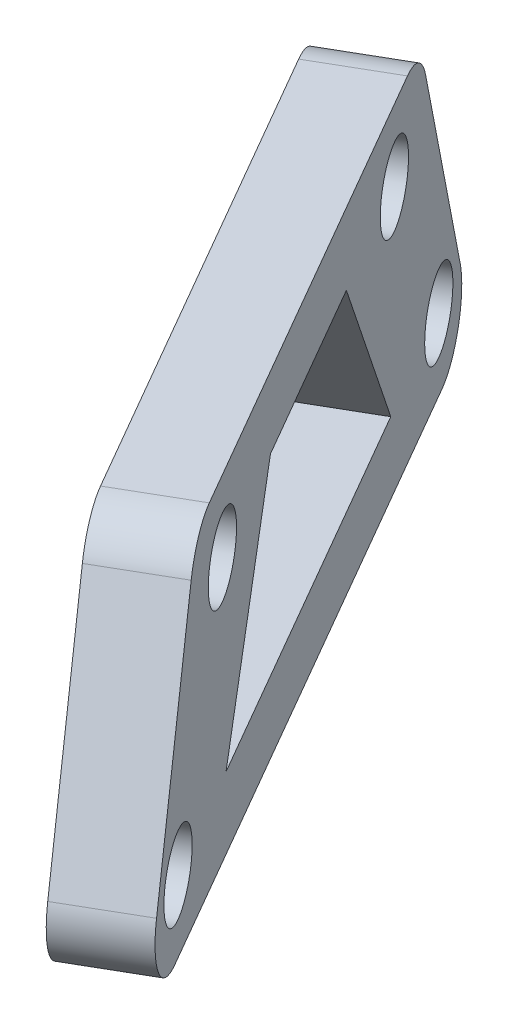
ISO-10303-21;
HEADER;
FILE_DESCRIPTION(('STEP AP214'),'2;1');
FILE_NAME('part.step','',(''),(''),'','','');
FILE_SCHEMA(('AUTOMOTIVE_DESIGN { 1 0 10303 214 1 1 1 1 }'));
ENDSEC;
DATA;
#1=APPLICATION_CONTEXT('core data for automotive mechanical design processes');
#2=APPLICATION_PROTOCOL_DEFINITION('international standard','automotive_design',2000,#1);
#3=PRODUCT_CONTEXT('',#1,'mechanical');
#4=PRODUCT('Part','Part','',(#3));
#5=PRODUCT_RELATED_PRODUCT_CATEGORY('part','',(#4));
#6=PRODUCT_DEFINITION_FORMATION('','',#4);
#7=PRODUCT_DEFINITION_CONTEXT('part definition',#1,'design');
#8=PRODUCT_DEFINITION('design','',#6,#7);
#9=PRODUCT_DEFINITION_SHAPE('','',#8);
#10=(LENGTH_UNIT() NAMED_UNIT(*) SI_UNIT(.MILLI.,.METRE.));
#11=(NAMED_UNIT(*) PLANE_ANGLE_UNIT() SI_UNIT($,.RADIAN.));
#12=(NAMED_UNIT(*) SI_UNIT($,.STERADIAN.) SOLID_ANGLE_UNIT());
#13=UNCERTAINTY_MEASURE_WITH_UNIT(LENGTH_MEASURE(1.E-05),#10,'distance_accuracy_value','');
#14=(GEOMETRIC_REPRESENTATION_CONTEXT(3) GLOBAL_UNCERTAINTY_ASSIGNED_CONTEXT((#13)) GLOBAL_UNIT_ASSIGNED_CONTEXT((#10,
#11,#12)) REPRESENTATION_CONTEXT('',''));
#15=CARTESIAN_POINT('',(0.,0.,0.));
#16=DIRECTION('',(0.,0.,1.));
#17=DIRECTION('',(1.,0.,0.));
#18=AXIS2_PLACEMENT_3D('',#15,#16,#17);
#19=CARTESIAN_POINT('',(2.98789255612336,118.055853922029,26.7488933733079));
#20=DIRECTION('',(0.,-1.,0.));
#21=DIRECTION('',(1.,0.,0.));
#22=AXIS2_PLACEMENT_3D('',#19,#20,#21);
#23=PLANE('',#22);
#24=DIRECTION('',(0.500000000000002,0.,0.866025403784437));
#25=VECTOR('',#24,1.);
#26=CARTESIAN_POINT('',(2.98789255612336,118.055853922029,26.7488933733079));
#27=LINE('',#26,#25);
#28=CARTESIAN_POINT('',(-19.6627885870859,118.055853922029,-12.4832371927726));
#29=VERTEX_POINT('',#28);
#30=CARTESIAN_POINT('',(0.741907032665852,118.055853922029,22.8587323336153));
#31=VERTEX_POINT('',#30);
#32=EDGE_CURVE('E197',#29,#31,#27,.T.);
#33=ORIENTED_EDGE('',*,*,#32,.T.);
#34=DIRECTION('',(-0.866025403784437,0.,0.500000000000002));
#35=VECTOR('',#34,1.);
#36=CARTESIAN_POINT('',(0.741907032665852,118.055853922029,22.8587323336153));
#37=LINE('',#36,#35);
#38=CARTESIAN_POINT('',(-3.1119060141749,118.055853922029,25.0837323336154));
#39=VERTEX_POINT('',#38);
#40=EDGE_CURVE('E221',#31,#39,#37,.T.);
#41=ORIENTED_EDGE('',*,*,#40,.T.);
#42=DIRECTION('',(0.500000000000002,0.,0.866025403784437));
#43=VECTOR('',#42,1.);
#44=CARTESIAN_POINT('',(-0.865920490717391,118.055853922029,28.9738933733079));
#45=LINE('',#44,#43);
#46=CARTESIAN_POINT('',(-23.5166016339266,118.055853922029,-10.2582371927726));
#47=VERTEX_POINT('',#46);
#48=EDGE_CURVE('E194',#47,#39,#45,.T.);
#49=ORIENTED_EDGE('',*,*,#48,.F.);
#50=DIRECTION('',(-0.866025403784438,0.,0.500000000000002));
#51=VECTOR('',#50,1.);
#52=CARTESIAN_POINT('',(-19.6627885870859,118.055853922029,-12.4832371927726));
#53=LINE('',#52,#51);
#54=EDGE_CURVE('E209',#47,#29,#53,.F.);
#55=ORIENTED_EDGE('',*,*,#54,.T.);
#56=EDGE_LOOP('',(#33,#41,#49,#55));
#57=FACE_BOUND('',#56,.T.);
#58=ADVANCED_FACE('F39',(#57),#23,.T.);
#59=CARTESIAN_POINT('',(-21.9087741105434,118.055853922029,-16.3733982324652));
#60=DIRECTION('',(-0.461854949510508,0.383092707383721,-0.799956238279355));
#61=DIRECTION('',(-0.866025403784438,0.,0.500000000000002));
#62=AXIS2_PLACEMENT_3D('',#59,#60,#61);
#63=PLANE('',#62);
#64=DIRECTION('',(-0.191546353691861,-0.923709899021013,-0.33176801659886));
#65=VECTOR('',#64,1.);
#66=CARTESIAN_POINT('',(-25.7625871573841,118.055853922029,-14.1483982324652));
#67=LINE('',#66,#65);
#68=CARTESIAN_POINT('',(-22.2596979383505,134.948127695094,-8.08121613181374));
#69=VERTEX_POINT('',#68);
#70=CARTESIAN_POINT('',(-24.9021664824582,122.20513204418,-12.6581059076107));
#71=VERTEX_POINT('',#70);
#72=EDGE_CURVE('E201',#69,#71,#67,.T.);
#73=ORIENTED_EDGE('',*,*,#72,.F.);
#74=DIRECTION('',(-0.866025403784438,0.,0.500000000000002));
#75=VECTOR('',#74,1.);
#76=CARTESIAN_POINT('',(-18.4058848915098,134.948127695094,-10.3062161318137));
#77=LINE('',#76,#75);
#78=CARTESIAN_POINT('',(-18.4058848915098,134.948127695094,-10.3062161318137));
#79=VERTEX_POINT('',#78);
#80=EDGE_CURVE('E11',#69,#79,#77,.F.);
#81=ORIENTED_EDGE('',*,*,#80,.T.);
#82=DIRECTION('',(-0.191546353691861,-0.923709899021013,-0.33176801659886));
#83=VECTOR('',#82,1.);
#84=CARTESIAN_POINT('',(-21.9087741105434,118.055853922029,-16.3733982324652));
#85=LINE('',#84,#83);
#86=CARTESIAN_POINT('',(-21.0483534356174,122.20513204418,-14.8831059076107));
#87=VERTEX_POINT('',#86);
#88=EDGE_CURVE('E206',#79,#87,#85,.T.);
#89=ORIENTED_EDGE('',*,*,#88,.T.);
#90=DIRECTION('',(-0.866025403784438,0.,0.500000000000002));
#91=VECTOR('',#90,1.);
#92=CARTESIAN_POINT('',(-21.0483534356174,122.20513204418,-14.8831059076107));
#93=LINE('',#92,#91);
#94=EDGE_CURVE('E47',#87,#71,#93,.T.);
#95=ORIENTED_EDGE('',*,*,#94,.T.);
#96=EDGE_LOOP('',(#73,#81,#89,#95));
#97=FACE_BOUND('',#96,.T.);
#98=ADVANCED_FACE('F251',(#97),#63,.T.);
#99=CARTESIAN_POINT('',(-18.0221074438767,136.798849572943,-9.64149409371414));
#100=DIRECTION('',(0.,1.,0.));
#101=DIRECTION('',(-1.,0.,0.));
#102=AXIS2_PLACEMENT_3D('',#99,#100,#101);
#103=PLANE('',#102);
#104=DIRECTION('',(-0.500000000000002,0.,-0.866025403784437));
#105=VECTOR('',#104,1.);
#106=CARTESIAN_POINT('',(-21.8759204907175,136.798849572943,-7.41649409371413));
#107=LINE('',#106,#105);
#108=CARTESIAN_POINT('',(-5.75437455828251,136.798849572943,20.5068425578184));
#109=VERTEX_POINT('',#108);
#110=CARTESIAN_POINT('',(-20.874133089819,136.798849572943,-5.68134741697567));
#111=VERTEX_POINT('',#110);
#112=EDGE_CURVE('E215',#109,#111,#107,.T.);
#113=ORIENTED_EDGE('',*,*,#112,.F.);
#114=DIRECTION('',(-0.866025403784437,0.,0.500000000000002));
#115=VECTOR('',#114,1.);
#116=CARTESIAN_POINT('',(-1.90056151144176,136.798849572943,18.2818425578184));
#117=LINE('',#116,#115);
#118=CARTESIAN_POINT('',(-1.90056151144176,136.798849572943,18.2818425578184));
#119=VERTEX_POINT('',#118);
#120=EDGE_CURVE('E61',#109,#119,#117,.F.);
#121=ORIENTED_EDGE('',*,*,#120,.T.);
#122=DIRECTION('',(-0.500000000000002,0.,-0.866025403784437));
#123=VECTOR('',#122,1.);
#124=CARTESIAN_POINT('',(-18.0221074438767,136.798849572943,-9.64149409371414));
#125=LINE('',#124,#123);
#126=CARTESIAN_POINT('',(-17.0203200429783,136.798849572943,-7.90634741697568));
#127=VERTEX_POINT('',#126);
#128=EDGE_CURVE('E204',#119,#127,#125,.T.);
#129=ORIENTED_EDGE('',*,*,#128,.T.);
#130=DIRECTION('',(-0.866025403784438,0.,0.500000000000002));
#131=VECTOR('',#130,1.);
#132=CARTESIAN_POINT('',(-17.0203200429783,136.798849572943,-7.90634741697568));
#133=LINE('',#132,#131);
#134=EDGE_CURVE('E244',#127,#111,#133,.T.);
#135=ORIENTED_EDGE('',*,*,#134,.T.);
#136=EDGE_LOOP('',(#113,#121,#129,#135));
#137=FACE_BOUND('',#136,.T.);
#138=ADVANCED_FACE('F261',(#137),#103,.T.);
#139=CARTESIAN_POINT('',(-0.898774110543323,136.798849572943,20.0169892345569));
#140=DIRECTION('',(0.461854949510508,0.383092707383721,0.799956238279355));
#141=DIRECTION('',(0.866025403784437,0.,-0.500000000000002));
#142=AXIS2_PLACEMENT_3D('',#139,#140,#141);
#143=PLANE('',#142);
#144=DIRECTION('',(-0.191546353691861,0.923709899021013,-0.331768016598861));
#145=VECTOR('',#144,1.);
#146=CARTESIAN_POINT('',(-4.75258715738407,136.798849572943,22.2419892345569));
#147=LINE('',#146,#145);
#148=CARTESIAN_POINT('',(-1.72634116564337,122.20513204418,27.4836010484534));
#149=VERTEX_POINT('',#148);
#150=CARTESIAN_POINT('',(-4.36880970975098,134.948127695094,22.9067112726565));
#151=VERTEX_POINT('',#150);
#152=EDGE_CURVE('E212',#149,#151,#147,.T.);
#153=ORIENTED_EDGE('',*,*,#152,.F.);
#154=DIRECTION('',(-0.866025403784437,0.,0.500000000000002));
#155=VECTOR('',#154,1.);
#156=CARTESIAN_POINT('',(2.12747188119737,122.20513204418,25.2586010484534));
#157=LINE('',#156,#155);
#158=CARTESIAN_POINT('',(2.12747188119737,122.20513204418,25.2586010484534));
#159=VERTEX_POINT('',#158);
#160=EDGE_CURVE('E235',#149,#159,#157,.F.);
#161=ORIENTED_EDGE('',*,*,#160,.T.);
#162=DIRECTION('',(-0.191546353691861,0.923709899021013,-0.331768016598861));
#163=VECTOR('',#162,1.);
#164=CARTESIAN_POINT('',(-0.898774110543323,136.798849572943,20.0169892345569));
#165=LINE('',#164,#163);
#166=CARTESIAN_POINT('',(-0.514996662910236,134.948127695094,20.6817112726565));
#167=VERTEX_POINT('',#166);
#168=EDGE_CURVE('E200',#159,#167,#165,.T.);
#169=ORIENTED_EDGE('',*,*,#168,.T.);
#170=DIRECTION('',(-0.866025403784437,0.,0.500000000000002));
#171=VECTOR('',#170,1.);
#172=CARTESIAN_POINT('',(-0.514996662910236,134.948127695094,20.6817112726565));
#173=LINE('',#172,#171);
#174=EDGE_CURVE('E232',#167,#151,#173,.T.);
#175=ORIENTED_EDGE('',*,*,#174,.T.);
#176=EDGE_LOOP('',(#153,#161,#169,#175));
#177=FACE_BOUND('',#176,.T.);
#178=ADVANCED_FACE('F269',(#177),#143,.T.);
#179=CARTESIAN_POINT('',(-9.34169117511047,0.,5.39342791463641));
#180=DIRECTION('',(0.866025403784438,0.,-0.500000000000002));
#181=DIRECTION('',(-0.500000000000002,0.,-0.866025403784438));
#182=AXIS2_PLACEMENT_3D('',#179,#180,#181);
#183=PLANE('',#182);
#184=DIRECTION('',(-0.266666666666667,0.845905169363301,-0.4618802153517));
#185=VECTOR('',#184,1.);
#186=CARTESIAN_POINT('',(-6.5634874995554,132.798849572943,10.2054178344723));
#187=LINE('',#186,#185);
#188=CARTESIAN_POINT('',(-3.17682083288866,122.055853922029,16.071296569439));
#189=VERTEX_POINT('',#188);
#190=CARTESIAN_POINT('',(-6.5634874995554,132.798849572943,10.2054178344723));
#191=VERTEX_POINT('',#190);
#192=EDGE_CURVE('E133',#189,#191,#187,.T.);
#193=ORIENTED_EDGE('',*,*,#192,.T.);
#194=DIRECTION('',(-0.500000000000002,0.,-0.866025403784437));
#195=VECTOR('',#194,1.);
#196=CARTESIAN_POINT('',(-12.3573940548675,132.798849572942,0.170077306365466));
#197=LINE('',#196,#195);
#198=CARTESIAN_POINT('',(-12.3573940548675,132.798849572942,0.170077306365466));
#199=VERTEX_POINT('',#198);
#200=EDGE_CURVE('E145',#191,#199,#197,.T.);
#201=ORIENTED_EDGE('',*,*,#200,.T.);
#202=DIRECTION('',(-0.266666666666668,-0.845905169363302,-0.461880215351699));
#203=VECTOR('',#202,1.);
#204=CARTESIAN_POINT('',(-15.7440607215342,122.055853922028,-5.69580142860114));
#205=LINE('',#204,#203);
#206=CARTESIAN_POINT('',(-15.7440607215342,122.055853922028,-5.69580142860114));
#207=VERTEX_POINT('',#206);
#208=EDGE_CURVE('E149',#199,#207,#205,.T.);
#209=ORIENTED_EDGE('',*,*,#208,.T.);
#210=DIRECTION('',(0.500000000000002,0.,0.866025403784437));
#211=VECTOR('',#210,1.);
#212=CARTESIAN_POINT('',(-3.17682083288866,122.055853922029,16.071296569439));
#213=LINE('',#212,#211);
#214=EDGE_CURVE('E141',#207,#189,#213,.T.);
#215=ORIENTED_EDGE('',*,*,#214,.T.);
#216=EDGE_LOOP('',(#193,#201,#209,#215));
#217=FACE_BOUND('',#216,.T.);
#218=CARTESIAN_POINT('',(-19.4087741105434,122.055853922029,-12.043271213543));
#219=DIRECTION('',(-0.866025403784438,0.,0.500000000000002));
#220=DIRECTION('',(0.500000000000002,0.,0.866025403784438));
#221=AXIS2_PLACEMENT_3D('',#218,#219,#220);
#222=CIRCLE('',#221,2.14999999999669);
#223=CARTESIAN_POINT('',(-18.333774110545,122.055853922029,-10.1813165954093));
#224=VERTEX_POINT('',#223);
#225=EDGE_CURVE('E173',#224,#224,#222,.T.);
#226=ORIENTED_EDGE('',*,*,#225,.T.);
#227=EDGE_LOOP('',(#226));
#228=FACE_BOUND('',#227,.T.);
#229=CARTESIAN_POINT('',(0.487892556123347,122.055853922029,22.4187663543857));
#230=DIRECTION('',(-0.866025403784438,0.,0.500000000000002));
#231=DIRECTION('',(0.500000000000002,0.,0.866025403784438));
#232=AXIS2_PLACEMENT_3D('',#229,#230,#231);
#233=CIRCLE('',#232,2.14999999999684);
#234=CARTESIAN_POINT('',(1.56289255612177,122.055853922029,24.2807209725195));
#235=VERTEX_POINT('',#234);
#236=EDGE_CURVE('E179',#235,#235,#233,.T.);
#237=ORIENTED_EDGE('',*,*,#236,.T.);
#238=EDGE_LOOP('',(#237));
#239=FACE_BOUND('',#238,.T.);
#240=CARTESIAN_POINT('',(-2.89877411054333,132.798849572943,16.5528876194191));
#241=DIRECTION('',(-0.866025403784438,0.,0.500000000000002));
#242=DIRECTION('',(0.500000000000002,0.,0.866025403784438));
#243=AXIS2_PLACEMENT_3D('',#240,#241,#242);
#244=CIRCLE('',#243,2.14999999999689);
#245=CARTESIAN_POINT('',(-1.82377411054488,132.798849572943,18.414842237553));
#246=VERTEX_POINT('',#245);
#247=EDGE_CURVE('E185',#246,#246,#244,.T.);
#248=ORIENTED_EDGE('',*,*,#247,.T.);
#249=EDGE_LOOP('',(#248));
#250=FACE_BOUND('',#249,.T.);
#251=CARTESIAN_POINT('',(-16.0221074438767,132.798849572943,-6.17739247857639));
#252=DIRECTION('',(-0.866025403784438,0.,0.500000000000002));
#253=DIRECTION('',(0.500000000000002,0.,0.866025403784438));
#254=AXIS2_PLACEMENT_3D('',#251,#252,#253);
#255=CIRCLE('',#254,2.14999999999664);
#256=CARTESIAN_POINT('',(-14.9471074438784,132.798849572943,-4.31543786044276));
#257=VERTEX_POINT('',#256);
#258=EDGE_CURVE('E191',#257,#257,#255,.T.);
#259=ORIENTED_EDGE('',*,*,#258,.T.);
#260=EDGE_LOOP('',(#259));
#261=FACE_BOUND('',#260,.T.);
#262=ORIENTED_EDGE('',*,*,#168,.F.);
#263=CARTESIAN_POINT('',(0.741907032665851,121.055853922029,22.8587323336153));
#264=DIRECTION('',(0.866025403784438,0.,-0.500000000000002));
#265=DIRECTION('',(-0.500000000000002,0.,-0.866025403784438));
#266=AXIS2_PLACEMENT_3D('',#263,#264,#265);
#267=CIRCLE('',#266,3.);
#268=EDGE_CURVE('E242',#159,#31,#267,.T.);
#269=ORIENTED_EDGE('',*,*,#268,.T.);
#270=ORIENTED_EDGE('',*,*,#32,.F.);
#271=CARTESIAN_POINT('',(-19.6627885870859,121.055853922029,-12.4832371927726));
#272=DIRECTION('',(0.866025403784438,0.,-0.500000000000002));
#273=DIRECTION('',(-0.500000000000002,0.,-0.866025403784438));
#274=AXIS2_PLACEMENT_3D('',#271,#272,#273);
#275=CIRCLE('',#274,3.);
#276=EDGE_CURVE('E237',#29,#87,#275,.T.);
#277=ORIENTED_EDGE('',*,*,#276,.T.);
#278=ORIENTED_EDGE('',*,*,#88,.F.);
#279=CARTESIAN_POINT('',(-17.0203200429783,133.798849572943,-7.90634741697568));
#280=DIRECTION('',(0.866025403784438,0.,-0.500000000000002));
#281=DIRECTION('',(-0.500000000000002,0.,-0.866025403784438));
#282=AXIS2_PLACEMENT_3D('',#279,#280,#281);
#283=CIRCLE('',#282,3.);
#284=EDGE_CURVE('E54',#79,#127,#283,.T.);
#285=ORIENTED_EDGE('',*,*,#284,.T.);
#286=ORIENTED_EDGE('',*,*,#128,.F.);
#287=CARTESIAN_POINT('',(-1.90056151144176,133.798849572943,18.2818425578184));
#288=DIRECTION('',(0.866025403784438,0.,-0.500000000000002));
#289=DIRECTION('',(-0.500000000000002,0.,-0.866025403784438));
#290=AXIS2_PLACEMENT_3D('',#287,#288,#289);
#291=CIRCLE('',#290,3.);
#292=EDGE_CURVE('E240',#119,#167,#291,.T.);
#293=ORIENTED_EDGE('',*,*,#292,.T.);
#294=EDGE_LOOP('',(#262,#269,#270,#277,#278,#285,#286,#293));
#295=FACE_BOUND('',#294,.T.);
#296=ADVANCED_FACE('F151',(#217,#228,#239,#250,#261,#295),#183,.T.);
#297=CARTESIAN_POINT('',(-13.1955042219512,0.,7.61842791463642));
#298=DIRECTION('',(0.866025403784438,0.,-0.500000000000002));
#299=DIRECTION('',(-0.500000000000002,0.,-0.866025403784438));
#300=AXIS2_PLACEMENT_3D('',#297,#298,#299);
#301=PLANE('',#300);
#302=DIRECTION('',(-0.500000000000002,0.,-0.866025403784437));
#303=VECTOR('',#302,1.);
#304=CARTESIAN_POINT('',(-16.2112071017082,132.798849572942,2.39507730636547));
#305=LINE('',#304,#303);
#306=CARTESIAN_POINT('',(-10.4173005463962,132.798849572943,12.4304178344723));
#307=VERTEX_POINT('',#306);
#308=CARTESIAN_POINT('',(-16.2112071017082,132.798849572942,2.39507730636547));
#309=VERTEX_POINT('',#308);
#310=EDGE_CURVE('E163',#307,#309,#305,.T.);
#311=ORIENTED_EDGE('',*,*,#310,.F.);
#312=DIRECTION('',(-0.266666666666667,0.845905169363301,-0.4618802153517));
#313=VECTOR('',#312,1.);
#314=CARTESIAN_POINT('',(-10.4173005463961,132.798849572943,12.4304178344723));
#315=LINE('',#314,#313);
#316=CARTESIAN_POINT('',(-7.0306338797294,122.055853922029,18.296296569439));
#317=VERTEX_POINT('',#316);
#318=EDGE_CURVE('E136',#317,#307,#315,.T.);
#319=ORIENTED_EDGE('',*,*,#318,.F.);
#320=DIRECTION('',(0.500000000000002,0.,0.866025403784437));
#321=VECTOR('',#320,1.);
#322=CARTESIAN_POINT('',(-7.0306338797294,122.055853922029,18.296296569439));
#323=LINE('',#322,#321);
#324=CARTESIAN_POINT('',(-19.5978737683749,122.055853922028,-3.47080142860114));
#325=VERTEX_POINT('',#324);
#326=EDGE_CURVE('E154',#325,#317,#323,.T.);
#327=ORIENTED_EDGE('',*,*,#326,.F.);
#328=DIRECTION('',(-0.266666666666668,-0.845905169363302,-0.461880215351699));
#329=VECTOR('',#328,1.);
#330=CARTESIAN_POINT('',(-19.5978737683749,122.055853922028,-3.47080142860114));
#331=LINE('',#330,#329);
#332=EDGE_CURVE('E157',#309,#325,#331,.T.);
#333=ORIENTED_EDGE('',*,*,#332,.F.);
#334=EDGE_LOOP('',(#311,#319,#327,#333));
#335=FACE_BOUND('',#334,.T.);
#336=CARTESIAN_POINT('',(-23.2625871573841,122.055853922029,-9.81827121354297));
#337=DIRECTION('',(-0.866025403784438,0.,0.500000000000002));
#338=DIRECTION('',(0.500000000000002,0.,0.866025403784438));
#339=AXIS2_PLACEMENT_3D('',#336,#337,#338);
#340=CIRCLE('',#339,2.14999999999669);
#341=CARTESIAN_POINT('',(-22.1875871573858,122.055853922029,-7.9563165954093));
#342=VERTEX_POINT('',#341);
#343=EDGE_CURVE('E169',#342,#342,#340,.T.);
#344=ORIENTED_EDGE('',*,*,#343,.F.);
#345=EDGE_LOOP('',(#344));
#346=FACE_BOUND('',#345,.T.);
#347=CARTESIAN_POINT('',(-3.3659204907174,122.055853922029,24.6437663543857));
#348=DIRECTION('',(-0.866025403784438,0.,0.500000000000002));
#349=DIRECTION('',(0.500000000000002,0.,0.866025403784438));
#350=AXIS2_PLACEMENT_3D('',#347,#348,#349);
#351=CIRCLE('',#350,2.14999999999684);
#352=CARTESIAN_POINT('',(-2.29092049071898,122.055853922029,26.5057209725195));
#353=VERTEX_POINT('',#352);
#354=EDGE_CURVE('E176',#353,#353,#351,.T.);
#355=ORIENTED_EDGE('',*,*,#354,.F.);
#356=EDGE_LOOP('',(#355));
#357=FACE_BOUND('',#356,.T.);
#358=CARTESIAN_POINT('',(-6.75258715738408,132.798849572943,18.7778876194191));
#359=DIRECTION('',(-0.866025403784438,0.,0.500000000000002));
#360=DIRECTION('',(0.500000000000002,0.,0.866025403784438));
#361=AXIS2_PLACEMENT_3D('',#358,#359,#360);
#362=CIRCLE('',#361,2.14999999999689);
#363=CARTESIAN_POINT('',(-5.67758715738563,132.798849572943,20.639842237553));
#364=VERTEX_POINT('',#363);
#365=EDGE_CURVE('E182',#364,#364,#362,.T.);
#366=ORIENTED_EDGE('',*,*,#365,.F.);
#367=EDGE_LOOP('',(#366));
#368=FACE_BOUND('',#367,.T.);
#369=CARTESIAN_POINT('',(-19.8759204907174,132.798849572943,-3.95239247857638));
#370=DIRECTION('',(-0.866025403784438,0.,0.500000000000002));
#371=DIRECTION('',(0.500000000000002,0.,0.866025403784438));
#372=AXIS2_PLACEMENT_3D('',#369,#370,#371);
#373=CIRCLE('',#372,2.14999999999664);
#374=CARTESIAN_POINT('',(-18.8009204907191,132.798849572943,-2.09043786044275));
#375=VERTEX_POINT('',#374);
#376=EDGE_CURVE('E188',#375,#375,#373,.T.);
#377=ORIENTED_EDGE('',*,*,#376,.F.);
#378=EDGE_LOOP('',(#377));
#379=FACE_BOUND('',#378,.T.);
#380=ORIENTED_EDGE('',*,*,#48,.T.);
#381=CARTESIAN_POINT('',(-3.1119060141749,121.055853922029,25.0837323336154));
#382=DIRECTION('',(0.866025403784438,0.,-0.500000000000002));
#383=DIRECTION('',(-0.500000000000002,0.,-0.866025403784438));
#384=AXIS2_PLACEMENT_3D('',#381,#382,#383);
#385=CIRCLE('',#384,3.);
#386=EDGE_CURVE('E230',#39,#149,#385,.F.);
#387=ORIENTED_EDGE('',*,*,#386,.T.);
#388=ORIENTED_EDGE('',*,*,#152,.T.);
#389=CARTESIAN_POINT('',(-5.75437455828251,133.798849572943,20.5068425578184));
#390=DIRECTION('',(0.866025403784438,0.,-0.500000000000002));
#391=DIRECTION('',(-0.500000000000002,0.,-0.866025403784438));
#392=AXIS2_PLACEMENT_3D('',#389,#390,#391);
#393=CIRCLE('',#392,3.);
#394=EDGE_CURVE('E228',#151,#109,#393,.F.);
#395=ORIENTED_EDGE('',*,*,#394,.T.);
#396=ORIENTED_EDGE('',*,*,#112,.T.);
#397=CARTESIAN_POINT('',(-20.874133089819,133.798849572943,-5.68134741697567));
#398=DIRECTION('',(0.866025403784438,0.,-0.500000000000002));
#399=DIRECTION('',(-0.500000000000002,0.,-0.866025403784438));
#400=AXIS2_PLACEMENT_3D('',#397,#398,#399);
#401=CIRCLE('',#400,3.);
#402=EDGE_CURVE('E226',#111,#69,#401,.F.);
#403=ORIENTED_EDGE('',*,*,#402,.T.);
#404=ORIENTED_EDGE('',*,*,#72,.T.);
#405=CARTESIAN_POINT('',(-23.5166016339266,121.055853922029,-10.2582371927726));
#406=DIRECTION('',(0.866025403784438,0.,-0.500000000000002));
#407=DIRECTION('',(-0.500000000000002,0.,-0.866025403784438));
#408=AXIS2_PLACEMENT_3D('',#405,#406,#407);
#409=CIRCLE('',#408,3.);
#410=EDGE_CURVE('E224',#71,#47,#409,.F.);
#411=ORIENTED_EDGE('',*,*,#410,.T.);
#412=EDGE_LOOP('',(#380,#387,#388,#395,#396,#403,#404,#411));
#413=FACE_BOUND('',#412,.T.);
#414=ADVANCED_FACE('F256',(#335,#346,#357,#368,#379,#413),#301,.F.);
#415=CARTESIAN_POINT('',(-16.0221074438767,132.798849572943,-6.17739247857639));
#416=DIRECTION('',(-0.866025403784438,0.,0.500000000000002));
#417=DIRECTION('',(0.500000000000002,0.,0.866025403784438));
#418=AXIS2_PLACEMENT_3D('',#415,#416,#417);
#419=CYLINDRICAL_SURFACE('',#418,2.14999999999664);
#420=ORIENTED_EDGE('',*,*,#258,.F.);
#421=EDGE_LOOP('',(#420));
#422=FACE_BOUND('',#421,.T.);
#423=ORIENTED_EDGE('',*,*,#376,.T.);
#424=EDGE_LOOP('',(#423));
#425=FACE_BOUND('',#424,.T.);
#426=ADVANCED_FACE('F373',(#422,#425),#419,.F.);
#427=CARTESIAN_POINT('',(-2.89877411054333,132.798849572943,16.5528876194191));
#428=DIRECTION('',(-0.866025403784438,0.,0.500000000000002));
#429=DIRECTION('',(0.500000000000002,0.,0.866025403784438));
#430=AXIS2_PLACEMENT_3D('',#427,#428,#429);
#431=CYLINDRICAL_SURFACE('',#430,2.14999999999689);
#432=ORIENTED_EDGE('',*,*,#247,.F.);
#433=EDGE_LOOP('',(#432));
#434=FACE_BOUND('',#433,.T.);
#435=ORIENTED_EDGE('',*,*,#365,.T.);
#436=EDGE_LOOP('',(#435));
#437=FACE_BOUND('',#436,.T.);
#438=ADVANCED_FACE('F364',(#434,#437),#431,.F.);
#439=CARTESIAN_POINT('',(0.487892556123347,122.055853922029,22.4187663543857));
#440=DIRECTION('',(-0.866025403784438,0.,0.500000000000002));
#441=DIRECTION('',(0.500000000000002,0.,0.866025403784438));
#442=AXIS2_PLACEMENT_3D('',#439,#440,#441);
#443=CYLINDRICAL_SURFACE('',#442,2.14999999999684);
#444=ORIENTED_EDGE('',*,*,#236,.F.);
#445=EDGE_LOOP('',(#444));
#446=FACE_BOUND('',#445,.T.);
#447=ORIENTED_EDGE('',*,*,#354,.T.);
#448=EDGE_LOOP('',(#447));
#449=FACE_BOUND('',#448,.T.);
#450=ADVANCED_FACE('F355',(#446,#449),#443,.F.);
#451=CARTESIAN_POINT('',(-19.4087741105434,122.055853922029,-12.043271213543));
#452=DIRECTION('',(-0.866025403784438,0.,0.500000000000002));
#453=DIRECTION('',(0.500000000000002,0.,0.866025403784438));
#454=AXIS2_PLACEMENT_3D('',#451,#452,#453);
#455=CYLINDRICAL_SURFACE('',#454,2.14999999999669);
#456=ORIENTED_EDGE('',*,*,#225,.F.);
#457=EDGE_LOOP('',(#456));
#458=FACE_BOUND('',#457,.T.);
#459=ORIENTED_EDGE('',*,*,#343,.T.);
#460=EDGE_LOOP('',(#459));
#461=FACE_BOUND('',#460,.T.);
#462=ADVANCED_FACE('F347',(#458,#461),#455,.F.);
#463=CARTESIAN_POINT('',(-6.5634874995554,132.798849572943,10.2054178344723));
#464=DIRECTION('',(0.422952584681652,0.533333333333334,0.732575365861196));
#465=DIRECTION('',(0.,-0.808446613530096,0.588569514222168));
#466=AXIS2_PLACEMENT_3D('',#463,#464,#465);
#467=PLANE('',#466);
#468=ORIENTED_EDGE('',*,*,#318,.T.);
#469=DIRECTION('',(-0.866025403784438,0.,0.500000000000002));
#470=VECTOR('',#469,1.);
#471=CARTESIAN_POINT('',(-6.5634874995554,132.798849572943,10.2054178344723));
#472=LINE('',#471,#470);
#473=EDGE_CURVE('E129',#191,#307,#472,.T.);
#474=ORIENTED_EDGE('',*,*,#473,.F.);
#475=ORIENTED_EDGE('',*,*,#192,.F.);
#476=DIRECTION('',(-0.866025403784438,0.,0.500000000000002));
#477=VECTOR('',#476,1.);
#478=CARTESIAN_POINT('',(-3.17682083288866,122.055853922029,16.071296569439));
#479=LINE('',#478,#477);
#480=EDGE_CURVE('E167',#189,#317,#479,.T.);
#481=ORIENTED_EDGE('',*,*,#480,.T.);
#482=EDGE_LOOP('',(#468,#474,#475,#481));
#483=FACE_BOUND('',#482,.T.);
#484=ADVANCED_FACE('F131',(#483),#467,.F.);
#485=CARTESIAN_POINT('',(-3.17682083288866,122.055853922029,16.071296569439));
#486=DIRECTION('',(0.,-1.,0.));
#487=DIRECTION('',(0.,0.,-1.));
#488=AXIS2_PLACEMENT_3D('',#485,#486,#487);
#489=PLANE('',#488);
#490=ORIENTED_EDGE('',*,*,#326,.T.);
#491=ORIENTED_EDGE('',*,*,#480,.F.);
#492=ORIENTED_EDGE('',*,*,#214,.F.);
#493=DIRECTION('',(-0.866025403784438,0.,0.500000000000002));
#494=VECTOR('',#493,1.);
#495=CARTESIAN_POINT('',(-15.7440607215342,122.055853922028,-5.69580142860114));
#496=LINE('',#495,#494);
#497=EDGE_CURVE('E170',#207,#325,#496,.T.);
#498=ORIENTED_EDGE('',*,*,#497,.T.);
#499=EDGE_LOOP('',(#490,#491,#492,#498));
#500=FACE_BOUND('',#499,.T.);
#501=ADVANCED_FACE('F330',(#500),#489,.F.);
#502=CARTESIAN_POINT('',(-15.7440607215342,122.055853922028,-5.69580142860114));
#503=DIRECTION('',(-0.422952584681652,0.533333333333333,-0.732575365861197));
#504=DIRECTION('',(0.,0.808446613530097,0.588569514222168));
#505=AXIS2_PLACEMENT_3D('',#502,#503,#504);
#506=PLANE('',#505);
#507=ORIENTED_EDGE('',*,*,#332,.T.);
#508=ORIENTED_EDGE('',*,*,#497,.F.);
#509=ORIENTED_EDGE('',*,*,#208,.F.);
#510=DIRECTION('',(-0.866025403784438,0.,0.500000000000002));
#511=VECTOR('',#510,1.);
#512=CARTESIAN_POINT('',(-12.3573940548675,132.798849572942,0.170077306365466));
#513=LINE('',#512,#511);
#514=EDGE_CURVE('E140',#199,#309,#513,.T.);
#515=ORIENTED_EDGE('',*,*,#514,.T.);
#516=EDGE_LOOP('',(#507,#508,#509,#515));
#517=FACE_BOUND('',#516,.T.);
#518=ADVANCED_FACE('F322',(#517),#506,.F.);
#519=CARTESIAN_POINT('',(-12.3573940548675,132.798849572942,0.170077306365466));
#520=DIRECTION('',(0.,1.,0.));
#521=DIRECTION('',(0.,0.,1.));
#522=AXIS2_PLACEMENT_3D('',#519,#520,#521);
#523=PLANE('',#522);
#524=ORIENTED_EDGE('',*,*,#310,.T.);
#525=ORIENTED_EDGE('',*,*,#514,.F.);
#526=ORIENTED_EDGE('',*,*,#200,.F.);
#527=ORIENTED_EDGE('',*,*,#473,.T.);
#528=EDGE_LOOP('',(#524,#525,#526,#527));
#529=FACE_BOUND('',#528,.T.);
#530=ADVANCED_FACE('F146',(#529),#523,.F.);
#531=CARTESIAN_POINT('',(0.741907032665853,121.055853922029,22.8587323336153));
#532=DIRECTION('',(-0.866025403784437,0.,0.500000000000002));
#533=DIRECTION('',(0.500000000000002,0.,0.866025403784438));
#534=AXIS2_PLACEMENT_3D('',#531,#532,#533);
#535=CYLINDRICAL_SURFACE('',#534,3.);
#536=ORIENTED_EDGE('',*,*,#268,.F.);
#537=ORIENTED_EDGE('',*,*,#160,.F.);
#538=ORIENTED_EDGE('',*,*,#386,.F.);
#539=ORIENTED_EDGE('',*,*,#40,.F.);
#540=EDGE_LOOP('',(#536,#537,#538,#539));
#541=FACE_BOUND('',#540,.T.);
#542=ADVANCED_FACE('F274',(#541),#535,.T.);
#543=CARTESIAN_POINT('',(-1.90056151144176,133.798849572943,18.2818425578184));
#544=DIRECTION('',(-0.866025403784437,0.,0.500000000000002));
#545=DIRECTION('',(0.500000000000002,0.,0.866025403784438));
#546=AXIS2_PLACEMENT_3D('',#543,#544,#545);
#547=CYLINDRICAL_SURFACE('',#546,3.);
#548=ORIENTED_EDGE('',*,*,#292,.F.);
#549=ORIENTED_EDGE('',*,*,#120,.F.);
#550=ORIENTED_EDGE('',*,*,#394,.F.);
#551=ORIENTED_EDGE('',*,*,#174,.F.);
#552=EDGE_LOOP('',(#548,#549,#550,#551));
#553=FACE_BOUND('',#552,.T.);
#554=ADVANCED_FACE('F266',(#553),#547,.T.);
#555=CARTESIAN_POINT('',(-17.0203200429783,133.798849572943,-7.90634741697568));
#556=DIRECTION('',(-0.866025403784438,0.,0.500000000000002));
#557=DIRECTION('',(0.500000000000002,0.,0.866025403784438));
#558=AXIS2_PLACEMENT_3D('',#555,#556,#557);
#559=CYLINDRICAL_SURFACE('',#558,3.);
#560=ORIENTED_EDGE('',*,*,#284,.F.);
#561=ORIENTED_EDGE('',*,*,#80,.F.);
#562=ORIENTED_EDGE('',*,*,#402,.F.);
#563=ORIENTED_EDGE('',*,*,#134,.F.);
#564=EDGE_LOOP('',(#560,#561,#562,#563));
#565=FACE_BOUND('',#564,.T.);
#566=ADVANCED_FACE('F260',(#565),#559,.T.);
#567=CARTESIAN_POINT('',(-19.6627885870859,121.055853922029,-12.4832371927726));
#568=DIRECTION('',(-0.866025403784438,0.,0.500000000000002));
#569=DIRECTION('',(0.500000000000002,0.,0.866025403784438));
#570=AXIS2_PLACEMENT_3D('',#567,#568,#569);
#571=CYLINDRICAL_SURFACE('',#570,3.);
#572=ORIENTED_EDGE('',*,*,#276,.F.);
#573=ORIENTED_EDGE('',*,*,#54,.F.);
#574=ORIENTED_EDGE('',*,*,#410,.F.);
#575=ORIENTED_EDGE('',*,*,#94,.F.);
#576=EDGE_LOOP('',(#572,#573,#574,#575));
#577=FACE_BOUND('',#576,.T.);
#578=ADVANCED_FACE('F41',(#577),#571,.T.);
#579=CLOSED_SHELL('',(#58,#98,#138,#178,#296,#414,#426,#438,#450,#462,#484,#501,#518,#530,#542,
#554,#566,#578));
#580=MANIFOLD_SOLID_BREP('B2',#579);
#581=ADVANCED_BREP_SHAPE_REPRESENTATION('',(#18,#580),#14);
#582=SHAPE_DEFINITION_REPRESENTATION(#9,#581);
ENDSEC;
END-ISO-10303-21;
